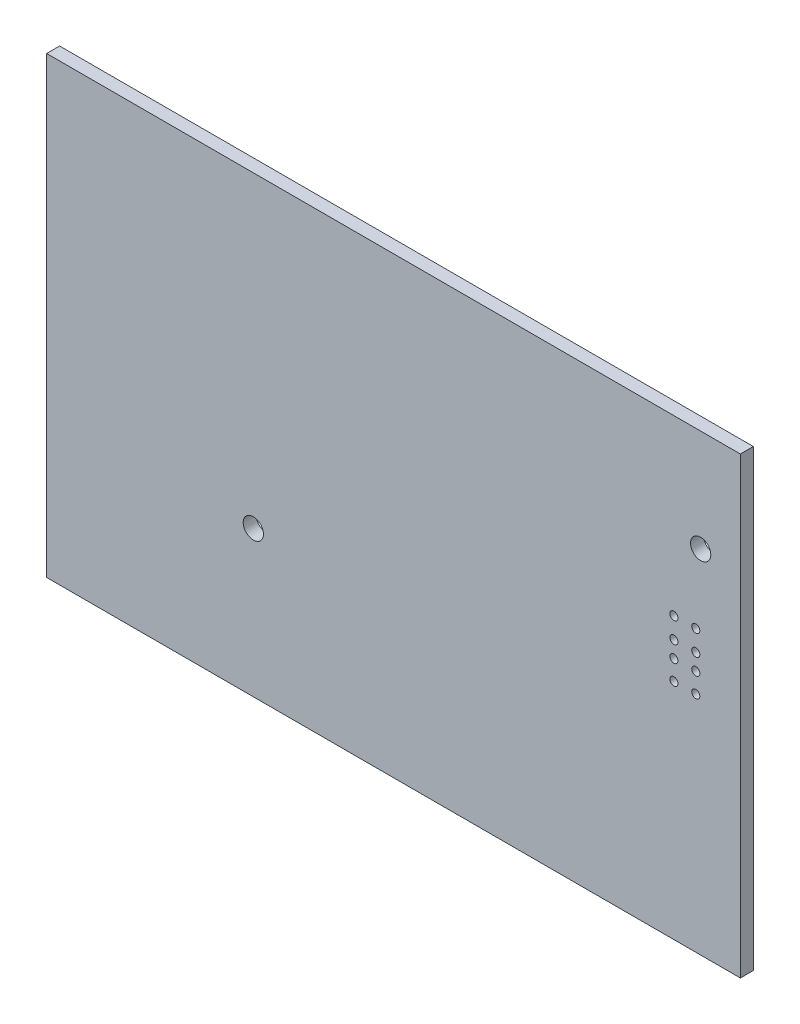
ISO-10303-21;
HEADER;
FILE_DESCRIPTION(('STEP AP214'),'2;1');
FILE_NAME('part.step','',(''),(''),'','','');
FILE_SCHEMA(('AUTOMOTIVE_DESIGN { 1 0 10303 214 1 1 1 1 }'));
ENDSEC;
DATA;
#1=APPLICATION_CONTEXT('core data for automotive mechanical design processes');
#2=APPLICATION_PROTOCOL_DEFINITION('international standard','automotive_design',2000,#1);
#3=PRODUCT_CONTEXT('',#1,'mechanical');
#4=PRODUCT('Part','Part','',(#3));
#5=PRODUCT_RELATED_PRODUCT_CATEGORY('part','',(#4));
#6=PRODUCT_DEFINITION_FORMATION('','',#4);
#7=PRODUCT_DEFINITION_CONTEXT('part definition',#1,'design');
#8=PRODUCT_DEFINITION('design','',#6,#7);
#9=PRODUCT_DEFINITION_SHAPE('','',#8);
#10=(LENGTH_UNIT() NAMED_UNIT(*) SI_UNIT(.MILLI.,.METRE.));
#11=(NAMED_UNIT(*) PLANE_ANGLE_UNIT() SI_UNIT($,.RADIAN.));
#12=(NAMED_UNIT(*) SI_UNIT($,.STERADIAN.) SOLID_ANGLE_UNIT());
#13=UNCERTAINTY_MEASURE_WITH_UNIT(LENGTH_MEASURE(1.E-05),#10,'distance_accuracy_value','');
#14=(GEOMETRIC_REPRESENTATION_CONTEXT(3) GLOBAL_UNCERTAINTY_ASSIGNED_CONTEXT((#13)) GLOBAL_UNIT_ASSIGNED_CONTEXT((#10,
#11,#12)) REPRESENTATION_CONTEXT('',''));
#15=CARTESIAN_POINT('',(0.,0.,0.));
#16=DIRECTION('',(0.,0.,1.));
#17=DIRECTION('',(1.,0.,0.));
#18=AXIS2_PLACEMENT_3D('',#15,#16,#17);
#19=CARTESIAN_POINT('',(-43.1,28.,1.6));
#20=DIRECTION('',(0.,1.,0.));
#21=DIRECTION('',(-1.,0.,0.));
#22=AXIS2_PLACEMENT_3D('',#19,#20,#21);
#23=PLANE('',#22);
#24=DIRECTION('',(1.,0.,0.));
#25=VECTOR('',#24,1.);
#26=CARTESIAN_POINT('',(-43.1,28.,0.));
#27=LINE('',#26,#25);
#28=CARTESIAN_POINT('',(-43.1,28.,0.));
#29=VERTEX_POINT('',#28);
#30=CARTESIAN_POINT('',(42.5,28.,0.));
#31=VERTEX_POINT('',#30);
#32=EDGE_CURVE('E101',#29,#31,#27,.T.);
#33=ORIENTED_EDGE('',*,*,#32,.F.);
#34=DIRECTION('',(0.,0.,-1.));
#35=VECTOR('',#34,1.);
#36=CARTESIAN_POINT('',(-43.1,28.,1.6));
#37=LINE('',#36,#35);
#38=CARTESIAN_POINT('',(-43.1,28.,1.6));
#39=VERTEX_POINT('',#38);
#40=EDGE_CURVE('E11',#39,#29,#37,.T.);
#41=ORIENTED_EDGE('',*,*,#40,.F.);
#42=DIRECTION('',(1.,0.,0.));
#43=VECTOR('',#42,1.);
#44=CARTESIAN_POINT('',(-43.1,28.,1.6));
#45=LINE('',#44,#43);
#46=CARTESIAN_POINT('',(42.5,28.,1.6));
#47=VERTEX_POINT('',#46);
#48=EDGE_CURVE('E94',#39,#47,#45,.T.);
#49=ORIENTED_EDGE('',*,*,#48,.T.);
#50=DIRECTION('',(0.,0.,-1.));
#51=VECTOR('',#50,1.);
#52=CARTESIAN_POINT('',(42.5,28.,1.6));
#53=LINE('',#52,#51);
#54=EDGE_CURVE('E77',#47,#31,#53,.T.);
#55=ORIENTED_EDGE('',*,*,#54,.T.);
#56=EDGE_LOOP('',(#33,#41,#49,#55));
#57=FACE_BOUND('',#56,.T.);
#58=ADVANCED_FACE('F34',(#57),#23,.T.);
#59=CARTESIAN_POINT('',(-43.1,-28.,1.6));
#60=DIRECTION('',(-1.,0.,0.));
#61=DIRECTION('',(0.,-1.,0.));
#62=AXIS2_PLACEMENT_3D('',#59,#60,#61);
#63=PLANE('',#62);
#64=DIRECTION('',(0.,1.,0.));
#65=VECTOR('',#64,1.);
#66=CARTESIAN_POINT('',(-43.1,-28.,0.));
#67=LINE('',#66,#65);
#68=CARTESIAN_POINT('',(-43.1,-28.,0.));
#69=VERTEX_POINT('',#68);
#70=EDGE_CURVE('E96',#69,#29,#67,.T.);
#71=ORIENTED_EDGE('',*,*,#70,.F.);
#72=DIRECTION('',(0.,0.,-1.));
#73=VECTOR('',#72,1.);
#74=CARTESIAN_POINT('',(-43.1,-28.,1.6));
#75=LINE('',#74,#73);
#76=CARTESIAN_POINT('',(-43.1,-28.,1.6));
#77=VERTEX_POINT('',#76);
#78=EDGE_CURVE('E43',#77,#69,#75,.T.);
#79=ORIENTED_EDGE('',*,*,#78,.F.);
#80=DIRECTION('',(0.,1.,0.));
#81=VECTOR('',#80,1.);
#82=CARTESIAN_POINT('',(-43.1,-28.,1.6));
#83=LINE('',#82,#81);
#84=EDGE_CURVE('E91',#77,#39,#83,.T.);
#85=ORIENTED_EDGE('',*,*,#84,.T.);
#86=ORIENTED_EDGE('',*,*,#40,.T.);
#87=EDGE_LOOP('',(#71,#79,#85,#86));
#88=FACE_BOUND('',#87,.T.);
#89=ADVANCED_FACE('F187',(#88),#63,.T.);
#90=CARTESIAN_POINT('',(42.5,-28.,1.6));
#91=DIRECTION('',(0.,-1.,0.));
#92=DIRECTION('',(0.,0.,-1.));
#93=AXIS2_PLACEMENT_3D('',#90,#91,#92);
#94=PLANE('',#93);
#95=DIRECTION('',(-1.,0.,0.));
#96=VECTOR('',#95,1.);
#97=CARTESIAN_POINT('',(42.5,-28.,0.));
#98=LINE('',#97,#96);
#99=CARTESIAN_POINT('',(42.5,-28.,0.));
#100=VERTEX_POINT('',#99);
#101=EDGE_CURVE('E85',#100,#69,#98,.T.);
#102=ORIENTED_EDGE('',*,*,#101,.F.);
#103=DIRECTION('',(0.,0.,-1.));
#104=VECTOR('',#103,1.);
#105=CARTESIAN_POINT('',(42.5,-28.,1.6));
#106=LINE('',#105,#104);
#107=CARTESIAN_POINT('',(42.5,-28.,1.6));
#108=VERTEX_POINT('',#107);
#109=EDGE_CURVE('E80',#108,#100,#106,.T.);
#110=ORIENTED_EDGE('',*,*,#109,.F.);
#111=DIRECTION('',(-1.,0.,0.));
#112=VECTOR('',#111,1.);
#113=CARTESIAN_POINT('',(42.5,-28.,1.6));
#114=LINE('',#113,#112);
#115=EDGE_CURVE('E83',#108,#77,#114,.T.);
#116=ORIENTED_EDGE('',*,*,#115,.T.);
#117=ORIENTED_EDGE('',*,*,#78,.T.);
#118=EDGE_LOOP('',(#102,#110,#116,#117));
#119=FACE_BOUND('',#118,.T.);
#120=ADVANCED_FACE('F82',(#119),#94,.T.);
#121=CARTESIAN_POINT('',(42.5,28.,1.6));
#122=DIRECTION('',(1.,0.,0.));
#123=DIRECTION('',(0.,0.,-1.));
#124=AXIS2_PLACEMENT_3D('',#121,#122,#123);
#125=PLANE('',#124);
#126=DIRECTION('',(0.,-1.,0.));
#127=VECTOR('',#126,1.);
#128=CARTESIAN_POINT('',(42.5,28.,0.));
#129=LINE('',#128,#127);
#130=EDGE_CURVE('E104',#31,#100,#129,.T.);
#131=ORIENTED_EDGE('',*,*,#130,.F.);
#132=ORIENTED_EDGE('',*,*,#54,.F.);
#133=DIRECTION('',(0.,-1.,0.));
#134=VECTOR('',#133,1.);
#135=CARTESIAN_POINT('',(42.5,28.,1.6));
#136=LINE('',#135,#134);
#137=EDGE_CURVE('E90',#47,#108,#136,.T.);
#138=ORIENTED_EDGE('',*,*,#137,.T.);
#139=ORIENTED_EDGE('',*,*,#109,.T.);
#140=EDGE_LOOP('',(#131,#132,#138,#139));
#141=FACE_BOUND('',#140,.T.);
#142=ADVANCED_FACE('F93',(#141),#125,.T.);
#143=CARTESIAN_POINT('',(0.,0.,1.6));
#144=DIRECTION('',(0.,0.,-1.));
#145=DIRECTION('',(-1.,0.,0.));
#146=AXIS2_PLACEMENT_3D('',#143,#144,#145);
#147=PLANE('',#146);
#148=CARTESIAN_POINT('',(-17.6,-10.,1.6));
#149=DIRECTION('',(0.,0.,1.));
#150=DIRECTION('',(1.,0.,0.));
#151=AXIS2_PLACEMENT_3D('',#148,#149,#150);
#152=CIRCLE('',#151,1.25);
#153=CARTESIAN_POINT('',(-16.35,-10.,1.6));
#154=VERTEX_POINT('',#153);
#155=EDGE_CURVE('E154',#154,#154,#152,.T.);
#156=ORIENTED_EDGE('',*,*,#155,.F.);
#157=EDGE_LOOP('',(#156));
#158=FACE_BOUND('',#157,.T.);
#159=CARTESIAN_POINT('',(37.6,15.4,1.6));
#160=DIRECTION('',(0.,0.,1.));
#161=DIRECTION('',(1.,0.,0.));
#162=AXIS2_PLACEMENT_3D('',#159,#160,#161);
#163=CIRCLE('',#162,1.25);
#164=CARTESIAN_POINT('',(38.85,15.4,1.6));
#165=VERTEX_POINT('',#164);
#166=EDGE_CURVE('E144',#165,#165,#163,.T.);
#167=ORIENTED_EDGE('',*,*,#166,.F.);
#168=EDGE_LOOP('',(#167));
#169=FACE_BOUND('',#168,.T.);
#170=CARTESIAN_POINT('',(37.,-0.4,1.6));
#171=DIRECTION('',(0.,0.,1.));
#172=DIRECTION('',(1.,0.,0.));
#173=AXIS2_PLACEMENT_3D('',#170,#171,#172);
#174=CIRCLE('',#173,0.499999999999999);
#175=CARTESIAN_POINT('',(37.5,-0.4,1.6));
#176=VERTEX_POINT('',#175);
#177=EDGE_CURVE('E141',#176,#176,#174,.T.);
#178=ORIENTED_EDGE('',*,*,#177,.F.);
#179=EDGE_LOOP('',(#178));
#180=FACE_BOUND('',#179,.T.);
#181=CARTESIAN_POINT('',(37.,2.04,1.6));
#182=DIRECTION('',(0.,0.,1.));
#183=DIRECTION('',(1.,0.,0.));
#184=AXIS2_PLACEMENT_3D('',#181,#182,#183);
#185=CIRCLE('',#184,0.499999999999999);
#186=CARTESIAN_POINT('',(37.5,2.04,1.6));
#187=VERTEX_POINT('',#186);
#188=EDGE_CURVE('E138',#187,#187,#185,.T.);
#189=ORIENTED_EDGE('',*,*,#188,.F.);
#190=EDGE_LOOP('',(#189));
#191=FACE_BOUND('',#190,.T.);
#192=CARTESIAN_POINT('',(37.,4.05,1.6));
#193=DIRECTION('',(0.,0.,1.));
#194=DIRECTION('',(1.,0.,0.));
#195=AXIS2_PLACEMENT_3D('',#192,#193,#194);
#196=CIRCLE('',#195,0.499999999999999);
#197=CARTESIAN_POINT('',(37.5,4.05,1.6));
#198=VERTEX_POINT('',#197);
#199=EDGE_CURVE('E134',#198,#198,#196,.T.);
#200=ORIENTED_EDGE('',*,*,#199,.F.);
#201=EDGE_LOOP('',(#200));
#202=FACE_BOUND('',#201,.T.);
#203=CARTESIAN_POINT('',(34.3,-0.4,1.6));
#204=DIRECTION('',(0.,0.,1.));
#205=DIRECTION('',(1.,0.,0.));
#206=AXIS2_PLACEMENT_3D('',#203,#204,#205);
#207=CIRCLE('',#206,0.499999999999999);
#208=CARTESIAN_POINT('',(34.8,-0.4,1.6));
#209=VERTEX_POINT('',#208);
#210=EDGE_CURVE('E130',#209,#209,#207,.T.);
#211=ORIENTED_EDGE('',*,*,#210,.F.);
#212=EDGE_LOOP('',(#211));
#213=FACE_BOUND('',#212,.T.);
#214=CARTESIAN_POINT('',(34.3,2.04,1.6));
#215=DIRECTION('',(0.,0.,1.));
#216=DIRECTION('',(1.,0.,0.));
#217=AXIS2_PLACEMENT_3D('',#214,#215,#216);
#218=CIRCLE('',#217,0.499999999999999);
#219=CARTESIAN_POINT('',(34.8,2.04,1.6));
#220=VERTEX_POINT('',#219);
#221=EDGE_CURVE('E126',#220,#220,#218,.T.);
#222=ORIENTED_EDGE('',*,*,#221,.F.);
#223=EDGE_LOOP('',(#222));
#224=FACE_BOUND('',#223,.T.);
#225=CARTESIAN_POINT('',(34.3,4.05,1.6));
#226=DIRECTION('',(0.,0.,1.));
#227=DIRECTION('',(1.,0.,0.));
#228=AXIS2_PLACEMENT_3D('',#225,#226,#227);
#229=CIRCLE('',#228,0.499999999999999);
#230=CARTESIAN_POINT('',(34.8,4.05,1.6));
#231=VERTEX_POINT('',#230);
#232=EDGE_CURVE('E122',#231,#231,#229,.T.);
#233=ORIENTED_EDGE('',*,*,#232,.F.);
#234=EDGE_LOOP('',(#233));
#235=FACE_BOUND('',#234,.T.);
#236=CARTESIAN_POINT('',(34.3,6.6,1.6));
#237=DIRECTION('',(0.,0.,1.));
#238=DIRECTION('',(1.,0.,0.));
#239=AXIS2_PLACEMENT_3D('',#236,#237,#238);
#240=CIRCLE('',#239,0.499999999999999);
#241=CARTESIAN_POINT('',(34.8,6.6,1.6));
#242=VERTEX_POINT('',#241);
#243=EDGE_CURVE('E118',#242,#242,#240,.T.);
#244=ORIENTED_EDGE('',*,*,#243,.F.);
#245=EDGE_LOOP('',(#244));
#246=FACE_BOUND('',#245,.T.);
#247=CARTESIAN_POINT('',(37.,6.6,1.6));
#248=DIRECTION('',(0.,0.,1.));
#249=DIRECTION('',(1.,0.,0.));
#250=AXIS2_PLACEMENT_3D('',#247,#248,#249);
#251=CIRCLE('',#250,0.499999999999999);
#252=CARTESIAN_POINT('',(37.5,6.6,1.6));
#253=VERTEX_POINT('',#252);
#254=EDGE_CURVE('E114',#253,#253,#251,.T.);
#255=ORIENTED_EDGE('',*,*,#254,.F.);
#256=EDGE_LOOP('',(#255));
#257=FACE_BOUND('',#256,.T.);
#258=ORIENTED_EDGE('',*,*,#48,.F.);
#259=ORIENTED_EDGE('',*,*,#84,.F.);
#260=ORIENTED_EDGE('',*,*,#115,.F.);
#261=ORIENTED_EDGE('',*,*,#137,.F.);
#262=EDGE_LOOP('',(#258,#259,#260,#261));
#263=FACE_BOUND('',#262,.T.);
#264=ADVANCED_FACE('F89',(#158,#169,#180,#191,#202,#213,#224,#235,#246,#257,#263),#147,.F.);
#265=CARTESIAN_POINT('',(0.,0.,0.));
#266=DIRECTION('',(0.,0.,-1.));
#267=DIRECTION('',(-1.,0.,0.));
#268=AXIS2_PLACEMENT_3D('',#265,#266,#267);
#269=PLANE('',#268);
#270=CARTESIAN_POINT('',(-17.6,-10.,0.));
#271=DIRECTION('',(0.,0.,-1.));
#272=DIRECTION('',(-1.,0.,0.));
#273=AXIS2_PLACEMENT_3D('',#270,#271,#272);
#274=CIRCLE('',#273,1.25);
#275=CARTESIAN_POINT('',(-18.85,-10.,0.));
#276=VERTEX_POINT('',#275);
#277=EDGE_CURVE('E37',#276,#276,#274,.T.);
#278=ORIENTED_EDGE('',*,*,#277,.F.);
#279=EDGE_LOOP('',(#278));
#280=FACE_BOUND('',#279,.T.);
#281=CARTESIAN_POINT('',(37.6,15.4,0.));
#282=DIRECTION('',(0.,0.,-1.));
#283=DIRECTION('',(-1.,0.,0.));
#284=AXIS2_PLACEMENT_3D('',#281,#282,#283);
#285=CIRCLE('',#284,1.25);
#286=CARTESIAN_POINT('',(36.35,15.4,0.));
#287=VERTEX_POINT('',#286);
#288=EDGE_CURVE('E142',#287,#287,#285,.T.);
#289=ORIENTED_EDGE('',*,*,#288,.F.);
#290=EDGE_LOOP('',(#289));
#291=FACE_BOUND('',#290,.T.);
#292=CARTESIAN_POINT('',(37.,-0.4,0.));
#293=DIRECTION('',(0.,0.,-1.));
#294=DIRECTION('',(-1.,0.,0.));
#295=AXIS2_PLACEMENT_3D('',#292,#293,#294);
#296=CIRCLE('',#295,0.499999999999999);
#297=CARTESIAN_POINT('',(36.5,-0.4,0.));
#298=VERTEX_POINT('',#297);
#299=EDGE_CURVE('E139',#298,#298,#296,.T.);
#300=ORIENTED_EDGE('',*,*,#299,.F.);
#301=EDGE_LOOP('',(#300));
#302=FACE_BOUND('',#301,.T.);
#303=CARTESIAN_POINT('',(37.,2.04,0.));
#304=DIRECTION('',(0.,0.,-1.));
#305=DIRECTION('',(-1.,0.,0.));
#306=AXIS2_PLACEMENT_3D('',#303,#304,#305);
#307=CIRCLE('',#306,0.499999999999999);
#308=CARTESIAN_POINT('',(36.5,2.04,0.));
#309=VERTEX_POINT('',#308);
#310=EDGE_CURVE('E135',#309,#309,#307,.T.);
#311=ORIENTED_EDGE('',*,*,#310,.F.);
#312=EDGE_LOOP('',(#311));
#313=FACE_BOUND('',#312,.T.);
#314=CARTESIAN_POINT('',(37.,4.05,0.));
#315=DIRECTION('',(0.,0.,-1.));
#316=DIRECTION('',(-1.,0.,0.));
#317=AXIS2_PLACEMENT_3D('',#314,#315,#316);
#318=CIRCLE('',#317,0.499999999999999);
#319=CARTESIAN_POINT('',(36.5,4.05,0.));
#320=VERTEX_POINT('',#319);
#321=EDGE_CURVE('E131',#320,#320,#318,.T.);
#322=ORIENTED_EDGE('',*,*,#321,.F.);
#323=EDGE_LOOP('',(#322));
#324=FACE_BOUND('',#323,.T.);
#325=CARTESIAN_POINT('',(34.3,-0.4,0.));
#326=DIRECTION('',(0.,0.,-1.));
#327=DIRECTION('',(-1.,0.,0.));
#328=AXIS2_PLACEMENT_3D('',#325,#326,#327);
#329=CIRCLE('',#328,0.499999999999999);
#330=CARTESIAN_POINT('',(33.8,-0.4,0.));
#331=VERTEX_POINT('',#330);
#332=EDGE_CURVE('E127',#331,#331,#329,.T.);
#333=ORIENTED_EDGE('',*,*,#332,.F.);
#334=EDGE_LOOP('',(#333));
#335=FACE_BOUND('',#334,.T.);
#336=CARTESIAN_POINT('',(34.3,2.04,0.));
#337=DIRECTION('',(0.,0.,-1.));
#338=DIRECTION('',(-1.,0.,0.));
#339=AXIS2_PLACEMENT_3D('',#336,#337,#338);
#340=CIRCLE('',#339,0.499999999999999);
#341=CARTESIAN_POINT('',(33.8,2.04,0.));
#342=VERTEX_POINT('',#341);
#343=EDGE_CURVE('E123',#342,#342,#340,.T.);
#344=ORIENTED_EDGE('',*,*,#343,.F.);
#345=EDGE_LOOP('',(#344));
#346=FACE_BOUND('',#345,.T.);
#347=CARTESIAN_POINT('',(34.3,4.05,0.));
#348=DIRECTION('',(0.,0.,-1.));
#349=DIRECTION('',(-1.,0.,0.));
#350=AXIS2_PLACEMENT_3D('',#347,#348,#349);
#351=CIRCLE('',#350,0.499999999999999);
#352=CARTESIAN_POINT('',(33.8,4.05,0.));
#353=VERTEX_POINT('',#352);
#354=EDGE_CURVE('E119',#353,#353,#351,.T.);
#355=ORIENTED_EDGE('',*,*,#354,.F.);
#356=EDGE_LOOP('',(#355));
#357=FACE_BOUND('',#356,.T.);
#358=CARTESIAN_POINT('',(34.3,6.6,0.));
#359=DIRECTION('',(0.,0.,-1.));
#360=DIRECTION('',(-1.,0.,0.));
#361=AXIS2_PLACEMENT_3D('',#358,#359,#360);
#362=CIRCLE('',#361,0.499999999999999);
#363=CARTESIAN_POINT('',(33.8,6.6,0.));
#364=VERTEX_POINT('',#363);
#365=EDGE_CURVE('E115',#364,#364,#362,.T.);
#366=ORIENTED_EDGE('',*,*,#365,.F.);
#367=EDGE_LOOP('',(#366));
#368=FACE_BOUND('',#367,.T.);
#369=CARTESIAN_POINT('',(37.,6.6,0.));
#370=DIRECTION('',(0.,0.,-1.));
#371=DIRECTION('',(-1.,0.,0.));
#372=AXIS2_PLACEMENT_3D('',#369,#370,#371);
#373=CIRCLE('',#372,0.499999999999999);
#374=CARTESIAN_POINT('',(36.5,6.6,0.));
#375=VERTEX_POINT('',#374);
#376=EDGE_CURVE('E105',#375,#375,#373,.T.);
#377=ORIENTED_EDGE('',*,*,#376,.F.);
#378=EDGE_LOOP('',(#377));
#379=FACE_BOUND('',#378,.T.);
#380=ORIENTED_EDGE('',*,*,#32,.T.);
#381=ORIENTED_EDGE('',*,*,#130,.T.);
#382=ORIENTED_EDGE('',*,*,#101,.T.);
#383=ORIENTED_EDGE('',*,*,#70,.T.);
#384=EDGE_LOOP('',(#380,#381,#382,#383));
#385=FACE_BOUND('',#384,.T.);
#386=ADVANCED_FACE('F174',(#280,#291,#302,#313,#324,#335,#346,#357,#368,#379,#385),#269,.T.);
#387=CARTESIAN_POINT('',(37.,6.6,-0.4));
#388=DIRECTION('',(0.,0.,1.));
#389=DIRECTION('',(1.,0.,0.));
#390=AXIS2_PLACEMENT_3D('',#387,#388,#389);
#391=CYLINDRICAL_SURFACE('',#390,0.499999999999999);
#392=ORIENTED_EDGE('',*,*,#376,.T.);
#393=EDGE_LOOP('',(#392));
#394=FACE_BOUND('',#393,.T.);
#395=ORIENTED_EDGE('',*,*,#254,.T.);
#396=EDGE_LOOP('',(#395));
#397=FACE_BOUND('',#396,.T.);
#398=ADVANCED_FACE('F171',(#394,#397),#391,.F.);
#399=CARTESIAN_POINT('',(34.3,6.6,-0.4));
#400=DIRECTION('',(0.,0.,1.));
#401=DIRECTION('',(1.,0.,0.));
#402=AXIS2_PLACEMENT_3D('',#399,#400,#401);
#403=CYLINDRICAL_SURFACE('',#402,0.499999999999999);
#404=ORIENTED_EDGE('',*,*,#365,.T.);
#405=EDGE_LOOP('',(#404));
#406=FACE_BOUND('',#405,.T.);
#407=ORIENTED_EDGE('',*,*,#243,.T.);
#408=EDGE_LOOP('',(#407));
#409=FACE_BOUND('',#408,.T.);
#410=ADVANCED_FACE('F213',(#406,#409),#403,.F.);
#411=CARTESIAN_POINT('',(34.3,4.05,-0.4));
#412=DIRECTION('',(0.,0.,1.));
#413=DIRECTION('',(1.,0.,0.));
#414=AXIS2_PLACEMENT_3D('',#411,#412,#413);
#415=CYLINDRICAL_SURFACE('',#414,0.499999999999999);
#416=ORIENTED_EDGE('',*,*,#354,.T.);
#417=EDGE_LOOP('',(#416));
#418=FACE_BOUND('',#417,.T.);
#419=ORIENTED_EDGE('',*,*,#232,.T.);
#420=EDGE_LOOP('',(#419));
#421=FACE_BOUND('',#420,.T.);
#422=ADVANCED_FACE('F223',(#418,#421),#415,.F.);
#423=CARTESIAN_POINT('',(34.3,2.04,-0.4));
#424=DIRECTION('',(0.,0.,1.));
#425=DIRECTION('',(1.,0.,0.));
#426=AXIS2_PLACEMENT_3D('',#423,#424,#425);
#427=CYLINDRICAL_SURFACE('',#426,0.499999999999999);
#428=ORIENTED_EDGE('',*,*,#343,.T.);
#429=EDGE_LOOP('',(#428));
#430=FACE_BOUND('',#429,.T.);
#431=ORIENTED_EDGE('',*,*,#221,.T.);
#432=EDGE_LOOP('',(#431));
#433=FACE_BOUND('',#432,.T.);
#434=ADVANCED_FACE('F233',(#430,#433),#427,.F.);
#435=CARTESIAN_POINT('',(34.3,-0.4,-0.4));
#436=DIRECTION('',(0.,0.,1.));
#437=DIRECTION('',(1.,0.,0.));
#438=AXIS2_PLACEMENT_3D('',#435,#436,#437);
#439=CYLINDRICAL_SURFACE('',#438,0.499999999999999);
#440=ORIENTED_EDGE('',*,*,#332,.T.);
#441=EDGE_LOOP('',(#440));
#442=FACE_BOUND('',#441,.T.);
#443=ORIENTED_EDGE('',*,*,#210,.T.);
#444=EDGE_LOOP('',(#443));
#445=FACE_BOUND('',#444,.T.);
#446=ADVANCED_FACE('F243',(#442,#445),#439,.F.);
#447=CARTESIAN_POINT('',(37.,4.05,-0.4));
#448=DIRECTION('',(0.,0.,1.));
#449=DIRECTION('',(1.,0.,0.));
#450=AXIS2_PLACEMENT_3D('',#447,#448,#449);
#451=CYLINDRICAL_SURFACE('',#450,0.499999999999999);
#452=ORIENTED_EDGE('',*,*,#321,.T.);
#453=EDGE_LOOP('',(#452));
#454=FACE_BOUND('',#453,.T.);
#455=ORIENTED_EDGE('',*,*,#199,.T.);
#456=EDGE_LOOP('',(#455));
#457=FACE_BOUND('',#456,.T.);
#458=ADVANCED_FACE('F253',(#454,#457),#451,.F.);
#459=CARTESIAN_POINT('',(37.,2.04,-0.4));
#460=DIRECTION('',(0.,0.,1.));
#461=DIRECTION('',(1.,0.,0.));
#462=AXIS2_PLACEMENT_3D('',#459,#460,#461);
#463=CYLINDRICAL_SURFACE('',#462,0.499999999999999);
#464=ORIENTED_EDGE('',*,*,#310,.T.);
#465=EDGE_LOOP('',(#464));
#466=FACE_BOUND('',#465,.T.);
#467=ORIENTED_EDGE('',*,*,#188,.T.);
#468=EDGE_LOOP('',(#467));
#469=FACE_BOUND('',#468,.T.);
#470=ADVANCED_FACE('F263',(#466,#469),#463,.F.);
#471=CARTESIAN_POINT('',(37.,-0.4,-0.4));
#472=DIRECTION('',(0.,0.,1.));
#473=DIRECTION('',(1.,0.,0.));
#474=AXIS2_PLACEMENT_3D('',#471,#472,#473);
#475=CYLINDRICAL_SURFACE('',#474,0.499999999999999);
#476=ORIENTED_EDGE('',*,*,#299,.T.);
#477=EDGE_LOOP('',(#476));
#478=FACE_BOUND('',#477,.T.);
#479=ORIENTED_EDGE('',*,*,#177,.T.);
#480=EDGE_LOOP('',(#479));
#481=FACE_BOUND('',#480,.T.);
#482=ADVANCED_FACE('F273',(#478,#481),#475,.F.);
#483=CARTESIAN_POINT('',(37.6,15.4,-8.4));
#484=DIRECTION('',(0.,0.,1.));
#485=DIRECTION('',(1.,0.,0.));
#486=AXIS2_PLACEMENT_3D('',#483,#484,#485);
#487=CYLINDRICAL_SURFACE('',#486,1.25);
#488=ORIENTED_EDGE('',*,*,#288,.T.);
#489=EDGE_LOOP('',(#488));
#490=FACE_BOUND('',#489,.T.);
#491=ORIENTED_EDGE('',*,*,#166,.T.);
#492=EDGE_LOOP('',(#491));
#493=FACE_BOUND('',#492,.T.);
#494=ADVANCED_FACE('F282',(#490,#493),#487,.F.);
#495=CARTESIAN_POINT('',(-17.6,-10.,-8.4));
#496=DIRECTION('',(0.,0.,1.));
#497=DIRECTION('',(1.,0.,0.));
#498=AXIS2_PLACEMENT_3D('',#495,#496,#497);
#499=CYLINDRICAL_SURFACE('',#498,1.25);
#500=ORIENTED_EDGE('',*,*,#277,.T.);
#501=EDGE_LOOP('',(#500));
#502=FACE_BOUND('',#501,.T.);
#503=ORIENTED_EDGE('',*,*,#155,.T.);
#504=EDGE_LOOP('',(#503));
#505=FACE_BOUND('',#504,.T.);
#506=ADVANCED_FACE('F301',(#502,#505),#499,.F.);
#507=CLOSED_SHELL('',(#58,#89,#120,#142,#264,#386,#398,#410,#422,#434,#446,#458,#470,#482,#494,#506));
#508=MANIFOLD_SOLID_BREP('B2',#507);
#509=ADVANCED_BREP_SHAPE_REPRESENTATION('',(#18,#508),#14);
#510=SHAPE_DEFINITION_REPRESENTATION(#9,#509);
ENDSEC;
END-ISO-10303-21;
